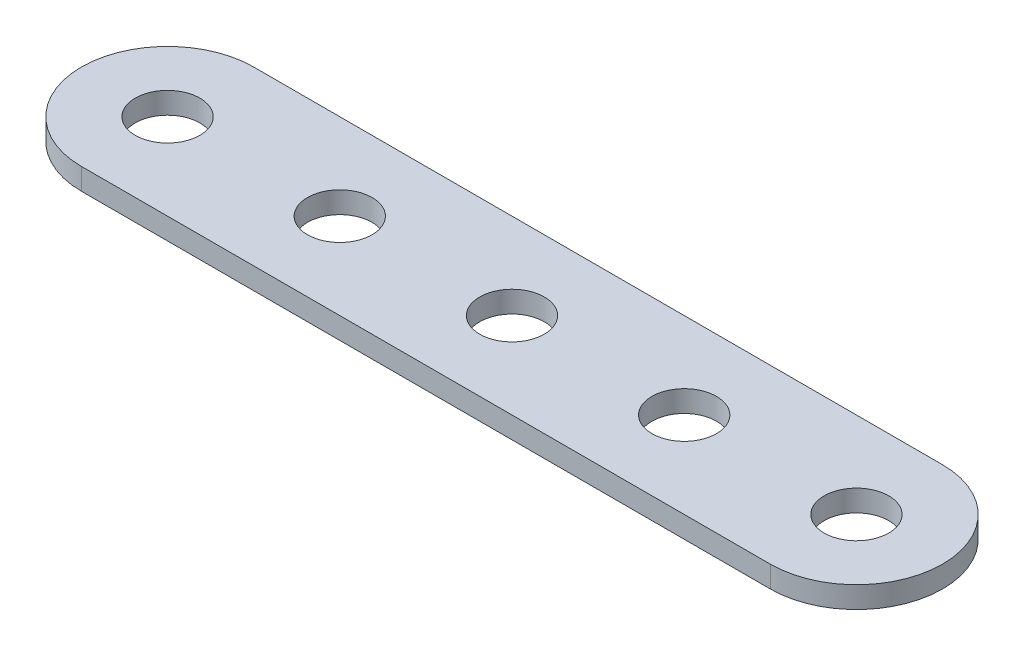
ISO-10303-21;
HEADER;
FILE_DESCRIPTION(('STEP AP214'),'2;1');
FILE_NAME('part.step','',(''),(''),'','','');
FILE_SCHEMA(('AUTOMOTIVE_DESIGN { 1 0 10303 214 1 1 1 1 }'));
ENDSEC;
DATA;
#1=APPLICATION_CONTEXT('core data for automotive mechanical design processes');
#2=APPLICATION_PROTOCOL_DEFINITION('international standard','automotive_design',2000,#1);
#3=PRODUCT_CONTEXT('',#1,'mechanical');
#4=PRODUCT('Part','Part','',(#3));
#5=PRODUCT_RELATED_PRODUCT_CATEGORY('part','',(#4));
#6=PRODUCT_DEFINITION_FORMATION('','',#4);
#7=PRODUCT_DEFINITION_CONTEXT('part definition',#1,'design');
#8=PRODUCT_DEFINITION('design','',#6,#7);
#9=PRODUCT_DEFINITION_SHAPE('','',#8);
#10=(LENGTH_UNIT() NAMED_UNIT(*) SI_UNIT(.MILLI.,.METRE.));
#11=(NAMED_UNIT(*) PLANE_ANGLE_UNIT() SI_UNIT($,.RADIAN.));
#12=(NAMED_UNIT(*) SI_UNIT($,.STERADIAN.) SOLID_ANGLE_UNIT());
#13=UNCERTAINTY_MEASURE_WITH_UNIT(LENGTH_MEASURE(1.E-05),#10,'distance_accuracy_value','');
#14=(GEOMETRIC_REPRESENTATION_CONTEXT(3) GLOBAL_UNCERTAINTY_ASSIGNED_CONTEXT((#13)) GLOBAL_UNIT_ASSIGNED_CONTEXT((#10,
#11,#12)) REPRESENTATION_CONTEXT('',''));
#15=CARTESIAN_POINT('',(0.,0.,0.));
#16=DIRECTION('',(0.,0.,1.));
#17=DIRECTION('',(1.,0.,0.));
#18=AXIS2_PLACEMENT_3D('',#15,#16,#17);
#19=CARTESIAN_POINT('',(25.4,1.5875,0.));
#20=DIRECTION('',(0.,1.,0.));
#21=DIRECTION('',(0.,0.,1.));
#22=AXIS2_PLACEMENT_3D('',#19,#20,#21);
#23=PLANE('',#22);
#24=CARTESIAN_POINT('',(12.7,1.5875,0.));
#25=DIRECTION('',(0.,1.,0.));
#26=DIRECTION('',(0.,0.,1.));
#27=AXIS2_PLACEMENT_3D('',#24,#25,#26);
#28=CIRCLE('',#27,2.38125);
#29=CARTESIAN_POINT('',(12.7,1.5875,2.38125));
#30=VERTEX_POINT('',#29);
#31=EDGE_CURVE('E127',#30,#30,#28,.T.);
#32=ORIENTED_EDGE('',*,*,#31,.F.);
#33=EDGE_LOOP('',(#32));
#34=FACE_BOUND('',#33,.T.);
#35=CARTESIAN_POINT('',(-12.7,1.5875,0.));
#36=DIRECTION('',(0.,1.,0.));
#37=DIRECTION('',(0.,0.,1.));
#38=AXIS2_PLACEMENT_3D('',#35,#36,#37);
#39=CIRCLE('',#38,2.38125);
#40=CARTESIAN_POINT('',(-12.7,1.5875,2.38125));
#41=VERTEX_POINT('',#40);
#42=EDGE_CURVE('E115',#41,#41,#39,.T.);
#43=ORIENTED_EDGE('',*,*,#42,.F.);
#44=EDGE_LOOP('',(#43));
#45=FACE_BOUND('',#44,.T.);
#46=CARTESIAN_POINT('',(25.4,1.5875,0.));
#47=DIRECTION('',(0.,1.,0.));
#48=DIRECTION('',(0.,0.,1.));
#49=AXIS2_PLACEMENT_3D('',#46,#47,#48);
#50=CIRCLE('',#49,6.35);
#51=CARTESIAN_POINT('',(25.4,1.5875,6.35));
#52=VERTEX_POINT('',#51);
#53=CARTESIAN_POINT('',(25.4,1.5875,-6.35));
#54=VERTEX_POINT('',#53);
#55=EDGE_CURVE('E85',#52,#54,#50,.T.);
#56=ORIENTED_EDGE('',*,*,#55,.T.);
#57=DIRECTION('',(-1.,0.,0.));
#58=VECTOR('',#57,1.);
#59=CARTESIAN_POINT('',(-25.4,1.5875,-6.35));
#60=LINE('',#59,#58);
#61=CARTESIAN_POINT('',(-25.4,1.5875,-6.35));
#62=VERTEX_POINT('',#61);
#63=EDGE_CURVE('E80',#54,#62,#60,.T.);
#64=ORIENTED_EDGE('',*,*,#63,.T.);
#65=CARTESIAN_POINT('',(-25.4,1.5875,0.));
#66=DIRECTION('',(0.,1.,0.));
#67=DIRECTION('',(0.,0.,1.));
#68=AXIS2_PLACEMENT_3D('',#65,#66,#67);
#69=CIRCLE('',#68,6.35);
#70=CARTESIAN_POINT('',(-25.4,1.5875,6.35));
#71=VERTEX_POINT('',#70);
#72=EDGE_CURVE('E83',#62,#71,#69,.T.);
#73=ORIENTED_EDGE('',*,*,#72,.T.);
#74=DIRECTION('',(1.,0.,0.));
#75=VECTOR('',#74,1.);
#76=CARTESIAN_POINT('',(-25.4,1.5875,6.35));
#77=LINE('',#76,#75);
#78=EDGE_CURVE('E50',#71,#52,#77,.T.);
#79=ORIENTED_EDGE('',*,*,#78,.T.);
#80=EDGE_LOOP('',(#56,#64,#73,#79));
#81=FACE_BOUND('',#80,.T.);
#82=CARTESIAN_POINT('',(-25.4,1.5875,0.));
#83=DIRECTION('',(0.,1.,0.));
#84=DIRECTION('',(0.,0.,1.));
#85=AXIS2_PLACEMENT_3D('',#82,#83,#84);
#86=CIRCLE('',#85,2.38125);
#87=CARTESIAN_POINT('',(-25.4,1.5875,2.38125));
#88=VERTEX_POINT('',#87);
#89=EDGE_CURVE('E100',#88,#88,#86,.T.);
#90=ORIENTED_EDGE('',*,*,#89,.F.);
#91=EDGE_LOOP('',(#90));
#92=FACE_BOUND('',#91,.T.);
#93=CARTESIAN_POINT('',(0.,1.5875,0.));
#94=DIRECTION('',(0.,1.,0.));
#95=DIRECTION('',(0.,0.,1.));
#96=AXIS2_PLACEMENT_3D('',#93,#94,#95);
#97=CIRCLE('',#96,2.38125);
#98=CARTESIAN_POINT('',(0.,1.5875,2.38125));
#99=VERTEX_POINT('',#98);
#100=EDGE_CURVE('E121',#99,#99,#97,.T.);
#101=ORIENTED_EDGE('',*,*,#100,.F.);
#102=EDGE_LOOP('',(#101));
#103=FACE_BOUND('',#102,.T.);
#104=CARTESIAN_POINT('',(25.4,1.5875,0.));
#105=DIRECTION('',(0.,1.,0.));
#106=DIRECTION('',(0.,0.,1.));
#107=AXIS2_PLACEMENT_3D('',#104,#105,#106);
#108=CIRCLE('',#107,2.38125);
#109=CARTESIAN_POINT('',(25.4,1.5875,2.38125));
#110=VERTEX_POINT('',#109);
#111=EDGE_CURVE('E133',#110,#110,#108,.T.);
#112=ORIENTED_EDGE('',*,*,#111,.F.);
#113=EDGE_LOOP('',(#112));
#114=FACE_BOUND('',#113,.T.);
#115=ADVANCED_FACE('F33',(#34,#45,#81,#92,#103,#114),#23,.T.);
#116=CARTESIAN_POINT('',(25.4,0.,0.));
#117=DIRECTION('',(0.,1.,0.));
#118=DIRECTION('',(0.,0.,1.));
#119=AXIS2_PLACEMENT_3D('',#116,#117,#118);
#120=PLANE('',#119);
#121=CARTESIAN_POINT('',(25.4,0.,0.));
#122=DIRECTION('',(0.,1.,0.));
#123=DIRECTION('',(0.,0.,1.));
#124=AXIS2_PLACEMENT_3D('',#121,#122,#123);
#125=CIRCLE('',#124,6.35);
#126=CARTESIAN_POINT('',(25.4,0.,6.35));
#127=VERTEX_POINT('',#126);
#128=CARTESIAN_POINT('',(25.4,0.,-6.35));
#129=VERTEX_POINT('',#128);
#130=EDGE_CURVE('E97',#127,#129,#125,.T.);
#131=ORIENTED_EDGE('',*,*,#130,.F.);
#132=DIRECTION('',(1.,0.,0.));
#133=VECTOR('',#132,1.);
#134=CARTESIAN_POINT('',(-25.4,0.,6.35));
#135=LINE('',#134,#133);
#136=CARTESIAN_POINT('',(-25.4,0.,6.35));
#137=VERTEX_POINT('',#136);
#138=EDGE_CURVE('E73',#137,#127,#135,.T.);
#139=ORIENTED_EDGE('',*,*,#138,.F.);
#140=CARTESIAN_POINT('',(-25.4,0.,0.));
#141=DIRECTION('',(0.,1.,0.));
#142=DIRECTION('',(0.,0.,1.));
#143=AXIS2_PLACEMENT_3D('',#140,#141,#142);
#144=CIRCLE('',#143,6.35);
#145=CARTESIAN_POINT('',(-25.4,0.,-6.35));
#146=VERTEX_POINT('',#145);
#147=EDGE_CURVE('E67',#146,#137,#144,.T.);
#148=ORIENTED_EDGE('',*,*,#147,.F.);
#149=DIRECTION('',(-1.,0.,0.));
#150=VECTOR('',#149,1.);
#151=CARTESIAN_POINT('',(-25.4,0.,-6.35));
#152=LINE('',#151,#150);
#153=EDGE_CURVE('E89',#129,#146,#152,.T.);
#154=ORIENTED_EDGE('',*,*,#153,.F.);
#155=EDGE_LOOP('',(#131,#139,#148,#154));
#156=FACE_BOUND('',#155,.T.);
#157=CARTESIAN_POINT('',(-25.4,0.,0.));
#158=DIRECTION('',(0.,1.,0.));
#159=DIRECTION('',(0.,0.,1.));
#160=AXIS2_PLACEMENT_3D('',#157,#158,#159);
#161=CIRCLE('',#160,2.38125);
#162=CARTESIAN_POINT('',(-25.4,0.,2.38125));
#163=VERTEX_POINT('',#162);
#164=EDGE_CURVE('E112',#163,#163,#161,.T.);
#165=ORIENTED_EDGE('',*,*,#164,.T.);
#166=EDGE_LOOP('',(#165));
#167=FACE_BOUND('',#166,.T.);
#168=CARTESIAN_POINT('',(-12.7,0.,0.));
#169=DIRECTION('',(0.,1.,0.));
#170=DIRECTION('',(0.,0.,1.));
#171=AXIS2_PLACEMENT_3D('',#168,#169,#170);
#172=CIRCLE('',#171,2.38125);
#173=CARTESIAN_POINT('',(-12.7,0.,2.38125));
#174=VERTEX_POINT('',#173);
#175=EDGE_CURVE('E118',#174,#174,#172,.T.);
#176=ORIENTED_EDGE('',*,*,#175,.T.);
#177=EDGE_LOOP('',(#176));
#178=FACE_BOUND('',#177,.T.);
#179=CARTESIAN_POINT('',(0.,0.,0.));
#180=DIRECTION('',(0.,1.,0.));
#181=DIRECTION('',(0.,0.,1.));
#182=AXIS2_PLACEMENT_3D('',#179,#180,#181);
#183=CIRCLE('',#182,2.38125);
#184=CARTESIAN_POINT('',(0.,0.,2.38125));
#185=VERTEX_POINT('',#184);
#186=EDGE_CURVE('E124',#185,#185,#183,.T.);
#187=ORIENTED_EDGE('',*,*,#186,.T.);
#188=EDGE_LOOP('',(#187));
#189=FACE_BOUND('',#188,.T.);
#190=CARTESIAN_POINT('',(12.7,0.,0.));
#191=DIRECTION('',(0.,1.,0.));
#192=DIRECTION('',(0.,0.,1.));
#193=AXIS2_PLACEMENT_3D('',#190,#191,#192);
#194=CIRCLE('',#193,2.38125);
#195=CARTESIAN_POINT('',(12.7,0.,2.38125));
#196=VERTEX_POINT('',#195);
#197=EDGE_CURVE('E130',#196,#196,#194,.T.);
#198=ORIENTED_EDGE('',*,*,#197,.T.);
#199=EDGE_LOOP('',(#198));
#200=FACE_BOUND('',#199,.T.);
#201=CARTESIAN_POINT('',(25.4,0.,0.));
#202=DIRECTION('',(0.,1.,0.));
#203=DIRECTION('',(0.,0.,1.));
#204=AXIS2_PLACEMENT_3D('',#201,#202,#203);
#205=CIRCLE('',#204,2.38125);
#206=CARTESIAN_POINT('',(25.4,0.,2.38125));
#207=VERTEX_POINT('',#206);
#208=EDGE_CURVE('E136',#207,#207,#205,.T.);
#209=ORIENTED_EDGE('',*,*,#208,.T.);
#210=EDGE_LOOP('',(#209));
#211=FACE_BOUND('',#210,.T.);
#212=ADVANCED_FACE('F108',(#156,#167,#178,#189,#200,#211),#120,.F.);
#213=CARTESIAN_POINT('',(25.4,1.5875,0.));
#214=DIRECTION('',(0.,-1.,0.));
#215=DIRECTION('',(0.,0.,-1.));
#216=AXIS2_PLACEMENT_3D('',#213,#214,#215);
#217=CYLINDRICAL_SURFACE('',#216,6.35);
#218=ORIENTED_EDGE('',*,*,#130,.T.);
#219=DIRECTION('',(0.,-1.,0.));
#220=VECTOR('',#219,1.);
#221=CARTESIAN_POINT('',(25.4,1.5875,-6.35));
#222=LINE('',#221,#220);
#223=EDGE_CURVE('E11',#54,#129,#222,.T.);
#224=ORIENTED_EDGE('',*,*,#223,.F.);
#225=ORIENTED_EDGE('',*,*,#55,.F.);
#226=DIRECTION('',(0.,-1.,0.));
#227=VECTOR('',#226,1.);
#228=CARTESIAN_POINT('',(25.4,1.5875,6.35));
#229=LINE('',#228,#227);
#230=EDGE_CURVE('E93',#52,#127,#229,.T.);
#231=ORIENTED_EDGE('',*,*,#230,.T.);
#232=EDGE_LOOP('',(#218,#224,#225,#231));
#233=FACE_BOUND('',#232,.T.);
#234=ADVANCED_FACE('F35',(#233),#217,.T.);
#235=CARTESIAN_POINT('',(-25.4,1.5875,-6.35));
#236=DIRECTION('',(0.,0.,1.));
#237=DIRECTION('',(1.,0.,0.));
#238=AXIS2_PLACEMENT_3D('',#235,#236,#237);
#239=PLANE('',#238);
#240=ORIENTED_EDGE('',*,*,#153,.T.);
#241=DIRECTION('',(0.,-1.,0.));
#242=VECTOR('',#241,1.);
#243=CARTESIAN_POINT('',(-25.4,1.5875,-6.35));
#244=LINE('',#243,#242);
#245=EDGE_CURVE('E42',#62,#146,#244,.T.);
#246=ORIENTED_EDGE('',*,*,#245,.F.);
#247=ORIENTED_EDGE('',*,*,#63,.F.);
#248=ORIENTED_EDGE('',*,*,#223,.T.);
#249=EDGE_LOOP('',(#240,#246,#247,#248));
#250=FACE_BOUND('',#249,.T.);
#251=ADVANCED_FACE('F88',(#250),#239,.F.);
#252=CARTESIAN_POINT('',(-25.4,1.5875,0.));
#253=DIRECTION('',(0.,-1.,0.));
#254=DIRECTION('',(0.,0.,-1.));
#255=AXIS2_PLACEMENT_3D('',#252,#253,#254);
#256=CYLINDRICAL_SURFACE('',#255,6.35);
#257=ORIENTED_EDGE('',*,*,#147,.T.);
#258=DIRECTION('',(0.,-1.,0.));
#259=VECTOR('',#258,1.);
#260=CARTESIAN_POINT('',(-25.4,1.5875,6.35));
#261=LINE('',#260,#259);
#262=EDGE_CURVE('E90',#71,#137,#261,.T.);
#263=ORIENTED_EDGE('',*,*,#262,.F.);
#264=ORIENTED_EDGE('',*,*,#72,.F.);
#265=ORIENTED_EDGE('',*,*,#245,.T.);
#266=EDGE_LOOP('',(#257,#263,#264,#265));
#267=FACE_BOUND('',#266,.T.);
#268=ADVANCED_FACE('F91',(#267),#256,.T.);
#269=CARTESIAN_POINT('',(-25.4,1.5875,6.35));
#270=DIRECTION('',(0.,0.,-1.));
#271=DIRECTION('',(-1.,0.,0.));
#272=AXIS2_PLACEMENT_3D('',#269,#270,#271);
#273=PLANE('',#272);
#274=ORIENTED_EDGE('',*,*,#138,.T.);
#275=ORIENTED_EDGE('',*,*,#230,.F.);
#276=ORIENTED_EDGE('',*,*,#78,.F.);
#277=ORIENTED_EDGE('',*,*,#262,.T.);
#278=EDGE_LOOP('',(#274,#275,#276,#277));
#279=FACE_BOUND('',#278,.T.);
#280=ADVANCED_FACE('F105',(#279),#273,.F.);
#281=CARTESIAN_POINT('',(-25.4,1.5875,0.));
#282=DIRECTION('',(0.,-1.,0.));
#283=DIRECTION('',(0.,0.,-1.));
#284=AXIS2_PLACEMENT_3D('',#281,#282,#283);
#285=CYLINDRICAL_SURFACE('',#284,2.38125);
#286=ORIENTED_EDGE('',*,*,#89,.T.);
#287=EDGE_LOOP('',(#286));
#288=FACE_BOUND('',#287,.T.);
#289=ORIENTED_EDGE('',*,*,#164,.F.);
#290=EDGE_LOOP('',(#289));
#291=FACE_BOUND('',#290,.T.);
#292=ADVANCED_FACE('F155',(#288,#291),#285,.F.);
#293=CARTESIAN_POINT('',(-12.7,1.5875,0.));
#294=DIRECTION('',(0.,-1.,0.));
#295=DIRECTION('',(0.,0.,-1.));
#296=AXIS2_PLACEMENT_3D('',#293,#294,#295);
#297=CYLINDRICAL_SURFACE('',#296,2.38125);
#298=ORIENTED_EDGE('',*,*,#42,.T.);
#299=EDGE_LOOP('',(#298));
#300=FACE_BOUND('',#299,.T.);
#301=ORIENTED_EDGE('',*,*,#175,.F.);
#302=EDGE_LOOP('',(#301));
#303=FACE_BOUND('',#302,.T.);
#304=ADVANCED_FACE('F201',(#300,#303),#297,.F.);
#305=CARTESIAN_POINT('',(0.,1.5875,0.));
#306=DIRECTION('',(0.,-1.,0.));
#307=DIRECTION('',(0.,0.,-1.));
#308=AXIS2_PLACEMENT_3D('',#305,#306,#307);
#309=CYLINDRICAL_SURFACE('',#308,2.38125);
#310=ORIENTED_EDGE('',*,*,#100,.T.);
#311=EDGE_LOOP('',(#310));
#312=FACE_BOUND('',#311,.T.);
#313=ORIENTED_EDGE('',*,*,#186,.F.);
#314=EDGE_LOOP('',(#313));
#315=FACE_BOUND('',#314,.T.);
#316=ADVANCED_FACE('F209',(#312,#315),#309,.F.);
#317=CARTESIAN_POINT('',(12.7,1.5875,0.));
#318=DIRECTION('',(0.,-1.,0.));
#319=DIRECTION('',(0.,0.,-1.));
#320=AXIS2_PLACEMENT_3D('',#317,#318,#319);
#321=CYLINDRICAL_SURFACE('',#320,2.38125);
#322=ORIENTED_EDGE('',*,*,#31,.T.);
#323=EDGE_LOOP('',(#322));
#324=FACE_BOUND('',#323,.T.);
#325=ORIENTED_EDGE('',*,*,#197,.F.);
#326=EDGE_LOOP('',(#325));
#327=FACE_BOUND('',#326,.T.);
#328=ADVANCED_FACE('F217',(#324,#327),#321,.F.);
#329=CARTESIAN_POINT('',(25.4,1.5875,0.));
#330=DIRECTION('',(0.,-1.,0.));
#331=DIRECTION('',(0.,0.,-1.));
#332=AXIS2_PLACEMENT_3D('',#329,#330,#331);
#333=CYLINDRICAL_SURFACE('',#332,2.38125);
#334=ORIENTED_EDGE('',*,*,#111,.T.);
#335=EDGE_LOOP('',(#334));
#336=FACE_BOUND('',#335,.T.);
#337=ORIENTED_EDGE('',*,*,#208,.F.);
#338=EDGE_LOOP('',(#337));
#339=FACE_BOUND('',#338,.T.);
#340=ADVANCED_FACE('F142',(#336,#339),#333,.F.);
#341=CLOSED_SHELL('',(#115,#212,#234,#251,#268,#280,#292,#304,#316,#328,#340));
#342=MANIFOLD_SOLID_BREP('B2',#341);
#343=ADVANCED_BREP_SHAPE_REPRESENTATION('',(#18,#342),#14);
#344=SHAPE_DEFINITION_REPRESENTATION(#9,#343);
ENDSEC;
END-ISO-10303-21;
